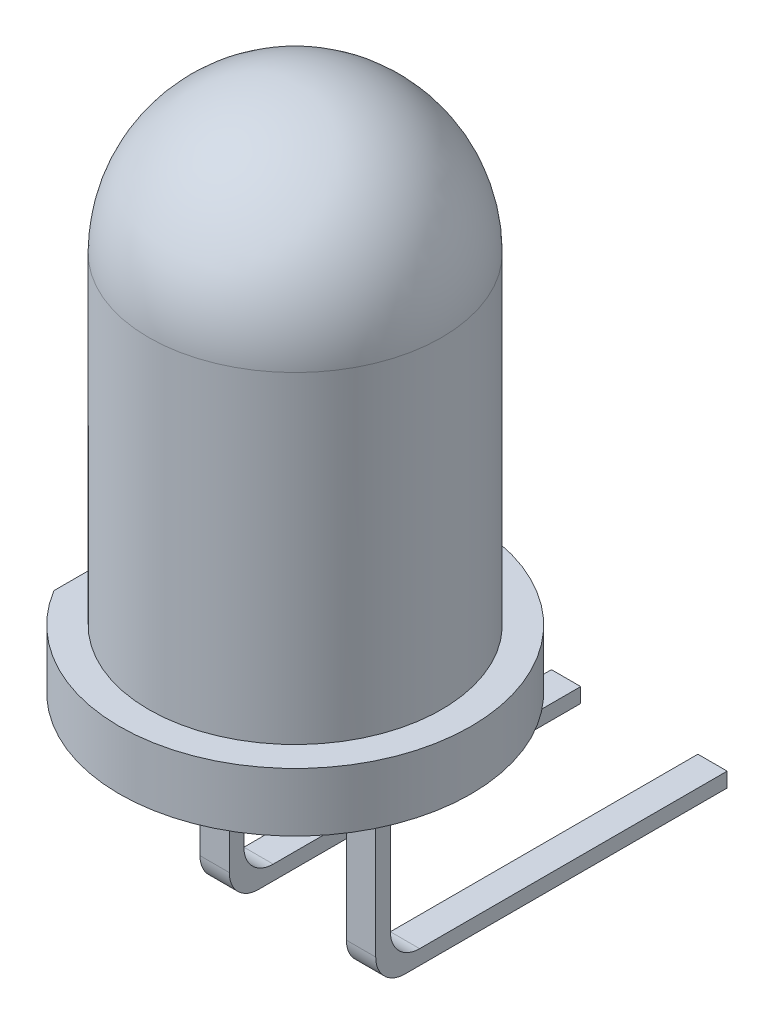
ISO-10303-21;
HEADER;
FILE_DESCRIPTION(('STEP AP214'),'2;1');
FILE_NAME('part.step','',(''),(''),'','','');
FILE_SCHEMA(('AUTOMOTIVE_DESIGN { 1 0 10303 214 1 1 1 1 }'));
ENDSEC;
DATA;
#1=APPLICATION_CONTEXT('core data for automotive mechanical design processes');
#2=APPLICATION_PROTOCOL_DEFINITION('international standard','automotive_design',2000,#1);
#3=PRODUCT_CONTEXT('',#1,'mechanical');
#4=PRODUCT('Part','Part','',(#3));
#5=PRODUCT_RELATED_PRODUCT_CATEGORY('part','',(#4));
#6=PRODUCT_DEFINITION_FORMATION('','',#4);
#7=PRODUCT_DEFINITION_CONTEXT('part definition',#1,'design');
#8=PRODUCT_DEFINITION('design','',#6,#7);
#9=PRODUCT_DEFINITION_SHAPE('','',#8);
#10=(LENGTH_UNIT() NAMED_UNIT(*) SI_UNIT(.MILLI.,.METRE.));
#11=(NAMED_UNIT(*) PLANE_ANGLE_UNIT() SI_UNIT($,.RADIAN.));
#12=(NAMED_UNIT(*) SI_UNIT($,.STERADIAN.) SOLID_ANGLE_UNIT());
#13=UNCERTAINTY_MEASURE_WITH_UNIT(LENGTH_MEASURE(1.E-05),#10,'distance_accuracy_value','');
#14=(GEOMETRIC_REPRESENTATION_CONTEXT(3) GLOBAL_UNCERTAINTY_ASSIGNED_CONTEXT((#13)) GLOBAL_UNIT_ASSIGNED_CONTEXT((#10,
#11,#12)) REPRESENTATION_CONTEXT('',''));
#15=CARTESIAN_POINT('',(0.,0.,0.));
#16=DIRECTION('',(0.,0.,1.));
#17=DIRECTION('',(1.,0.,0.));
#18=AXIS2_PLACEMENT_3D('',#15,#16,#17);
#19=CARTESIAN_POINT('',(7.50520607473216,-10.0975485762322,0.125));
#20=DIRECTION('',(0.,-1.,0.));
#21=DIRECTION('',(0.,0.,-1.));
#22=AXIS2_PLACEMENT_3D('',#19,#20,#21);
#23=PLANE('',#22);
#24=DIRECTION('',(0.,0.,1.));
#25=VECTOR('',#24,1.);
#26=CARTESIAN_POINT('',(-1.,-10.0975485762322,-9.875));
#27=LINE('',#26,#25);
#28=CARTESIAN_POINT('',(-1.,-10.0975485762322,-5.875));
#29=VERTEX_POINT('',#28);
#30=CARTESIAN_POINT('',(-1.,-10.0975485762322,-0.375));
#31=VERTEX_POINT('',#30);
#32=EDGE_CURVE('E168',#29,#31,#27,.T.);
#33=ORIENTED_EDGE('',*,*,#32,.T.);
#34=DIRECTION('',(-1.,0.,0.));
#35=VECTOR('',#34,1.);
#36=CARTESIAN_POINT('',(-1.5,-10.0975485762322,-0.375));
#37=LINE('',#36,#35);
#38=CARTESIAN_POINT('',(-1.5,-10.0975485762322,-0.375));
#39=VERTEX_POINT('',#38);
#40=EDGE_CURVE('E280',#31,#39,#37,.T.);
#41=ORIENTED_EDGE('',*,*,#40,.T.);
#42=DIRECTION('',(0.,0.,1.));
#43=VECTOR('',#42,1.);
#44=CARTESIAN_POINT('',(-1.5,-10.0975485762322,0.125));
#45=LINE('',#44,#43);
#46=CARTESIAN_POINT('',(-1.5,-10.0975485762322,-5.875));
#47=VERTEX_POINT('',#46);
#48=EDGE_CURVE('E189',#47,#39,#45,.T.);
#49=ORIENTED_EDGE('',*,*,#48,.F.);
#50=DIRECTION('',(-1.,0.,0.));
#51=VECTOR('',#50,1.);
#52=CARTESIAN_POINT('',(7.50520607473216,-10.0975485762322,-5.875));
#53=LINE('',#52,#51);
#54=EDGE_CURVE('E182',#29,#47,#53,.T.);
#55=ORIENTED_EDGE('',*,*,#54,.F.);
#56=EDGE_LOOP('',(#33,#41,#49,#55));
#57=FACE_BOUND('',#56,.T.);
#58=ADVANCED_FACE('F33',(#57),#23,.T.);
#59=CARTESIAN_POINT('',(7.50520607473216,-10.0975485762322,-5.875));
#60=DIRECTION('',(0.,0.,-1.));
#61=DIRECTION('',(-1.,0.,0.));
#62=AXIS2_PLACEMENT_3D('',#59,#60,#61);
#63=PLANE('',#62);
#64=DIRECTION('',(0.,1.,0.));
#65=VECTOR('',#64,1.);
#66=CARTESIAN_POINT('',(-0.999999999999999,-10.0975485762322,-5.875));
#67=LINE('',#66,#65);
#68=CARTESIAN_POINT('',(-0.999999999999999,-9.84754857623216,-5.875));
#69=VERTEX_POINT('',#68);
#70=EDGE_CURVE('E177',#29,#69,#67,.T.);
#71=ORIENTED_EDGE('',*,*,#70,.F.);
#72=ORIENTED_EDGE('',*,*,#54,.T.);
#73=DIRECTION('',(0.,-1.,0.));
#74=VECTOR('',#73,1.);
#75=CARTESIAN_POINT('',(-1.5,-10.0975485762322,-5.875));
#76=LINE('',#75,#74);
#77=CARTESIAN_POINT('',(-1.5,-9.84754857623216,-5.875));
#78=VERTEX_POINT('',#77);
#79=EDGE_CURVE('E304',#78,#47,#76,.T.);
#80=ORIENTED_EDGE('',*,*,#79,.F.);
#81=DIRECTION('',(-1.,0.,0.));
#82=VECTOR('',#81,1.);
#83=CARTESIAN_POINT('',(7.50520607473216,-9.84754857623216,-5.875));
#84=LINE('',#83,#82);
#85=EDGE_CURVE('E192',#69,#78,#84,.T.);
#86=ORIENTED_EDGE('',*,*,#85,.F.);
#87=EDGE_LOOP('',(#71,#72,#80,#86));
#88=FACE_BOUND('',#87,.T.);
#89=ADVANCED_FACE('F332',(#88),#63,.T.);
#90=CARTESIAN_POINT('',(7.50520607473216,-9.84754857623216,-5.875));
#91=DIRECTION('',(0.,1.,0.));
#92=DIRECTION('',(0.,0.,1.));
#93=AXIS2_PLACEMENT_3D('',#90,#91,#92);
#94=PLANE('',#93);
#95=DIRECTION('',(0.,0.,-1.));
#96=VECTOR('',#95,1.);
#97=CARTESIAN_POINT('',(-1.5,-9.84754857623216,-5.875));
#98=LINE('',#97,#96);
#99=CARTESIAN_POINT('',(-1.5,-9.84754857623216,-0.625));
#100=VERTEX_POINT('',#99);
#101=EDGE_CURVE('E294',#100,#78,#98,.T.);
#102=ORIENTED_EDGE('',*,*,#101,.F.);
#103=DIRECTION('',(-1.,0.,0.));
#104=VECTOR('',#103,1.);
#105=CARTESIAN_POINT('',(7.50520607473216,-9.84754857623216,-0.624999999999999));
#106=LINE('',#105,#104);
#107=CARTESIAN_POINT('',(-0.999999999999999,-9.84754857623216,-0.625));
#108=VERTEX_POINT('',#107);
#109=EDGE_CURVE('E271',#100,#108,#106,.F.);
#110=ORIENTED_EDGE('',*,*,#109,.T.);
#111=DIRECTION('',(0.,0.,1.));
#112=VECTOR('',#111,1.);
#113=CARTESIAN_POINT('',(-0.999999999999999,-9.84754857623216,-5.875));
#114=LINE('',#113,#112);
#115=EDGE_CURVE('E260',#69,#108,#114,.T.);
#116=ORIENTED_EDGE('',*,*,#115,.F.);
#117=ORIENTED_EDGE('',*,*,#85,.T.);
#118=EDGE_LOOP('',(#102,#110,#116,#117));
#119=FACE_BOUND('',#118,.T.);
#120=ADVANCED_FACE('F300',(#119),#94,.T.);
#121=CARTESIAN_POINT('',(-1.,-36.5,0.125));
#122=DIRECTION('',(-1.,0.,0.));
#123=DIRECTION('',(0.,0.,1.));
#124=AXIS2_PLACEMENT_3D('',#121,#122,#123);
#125=PLANE('',#124);
#126=DIRECTION('',(0.,1.,0.));
#127=VECTOR('',#126,1.);
#128=CARTESIAN_POINT('',(-1.,-36.5,0.125));
#129=LINE('',#128,#127);
#130=CARTESIAN_POINT('',(-1.,-9.59754857623216,0.125));
#131=VERTEX_POINT('',#130);
#132=CARTESIAN_POINT('',(-1.,-6.5,0.125));
#133=VERTEX_POINT('',#132);
#134=EDGE_CURVE('E216',#131,#133,#129,.T.);
#135=ORIENTED_EDGE('',*,*,#134,.F.);
#136=CARTESIAN_POINT('',(-1.,-9.59754857623216,-0.375));
#137=DIRECTION('',(-1.,0.,0.));
#138=DIRECTION('',(0.,0.,1.));
#139=AXIS2_PLACEMENT_3D('',#136,#137,#138);
#140=CIRCLE('',#139,0.5);
#141=EDGE_CURVE('E285',#131,#31,#140,.F.);
#142=ORIENTED_EDGE('',*,*,#141,.T.);
#143=ORIENTED_EDGE('',*,*,#32,.F.);
#144=ORIENTED_EDGE('',*,*,#70,.T.);
#145=ORIENTED_EDGE('',*,*,#115,.T.);
#146=CARTESIAN_POINT('',(-1.,-9.34754857623216,-0.625));
#147=DIRECTION('',(-1.,0.,0.));
#148=DIRECTION('',(0.,0.,1.));
#149=AXIS2_PLACEMENT_3D('',#146,#147,#148);
#150=CIRCLE('',#149,0.5);
#151=CARTESIAN_POINT('',(-1.,-9.34754857623216,-0.125));
#152=VERTEX_POINT('',#151);
#153=EDGE_CURVE('E11',#108,#152,#150,.T.);
#154=ORIENTED_EDGE('',*,*,#153,.T.);
#155=DIRECTION('',(0.,1.,0.));
#156=VECTOR('',#155,1.);
#157=CARTESIAN_POINT('',(-1.,-36.5,-0.125));
#158=LINE('',#157,#156);
#159=CARTESIAN_POINT('',(-1.,-6.5,-0.125));
#160=VERTEX_POINT('',#159);
#161=EDGE_CURVE('E218',#152,#160,#158,.T.);
#162=ORIENTED_EDGE('',*,*,#161,.T.);
#163=DIRECTION('',(0.,0.,1.));
#164=VECTOR('',#163,1.);
#165=CARTESIAN_POINT('',(-1.,-6.5,0.125));
#166=LINE('',#165,#164);
#167=EDGE_CURVE('E213',#160,#133,#166,.T.);
#168=ORIENTED_EDGE('',*,*,#167,.T.);
#169=EDGE_LOOP('',(#135,#142,#143,#144,#145,#154,#162,#168));
#170=FACE_BOUND('',#169,.T.);
#171=ADVANCED_FACE('F310',(#170),#125,.F.);
#172=CARTESIAN_POINT('',(1.,-36.5,0.125));
#173=DIRECTION('',(1.,0.,0.));
#174=DIRECTION('',(0.,0.,-1.));
#175=AXIS2_PLACEMENT_3D('',#172,#173,#174);
#176=PLANE('',#175);
#177=DIRECTION('',(0.,0.,1.));
#178=VECTOR('',#177,1.);
#179=CARTESIAN_POINT('',(1.,-10.0975485762322,-9.875));
#180=LINE('',#179,#178);
#181=CARTESIAN_POINT('',(1.,-10.0975485762322,-5.875));
#182=VERTEX_POINT('',#181);
#183=CARTESIAN_POINT('',(1.,-10.0975485762322,-0.375));
#184=VERTEX_POINT('',#183);
#185=EDGE_CURVE('E158',#182,#184,#180,.T.);
#186=ORIENTED_EDGE('',*,*,#185,.T.);
#187=CARTESIAN_POINT('',(1.,-9.59754857623216,-0.375));
#188=DIRECTION('',(1.,0.,0.));
#189=DIRECTION('',(0.,0.,-1.));
#190=AXIS2_PLACEMENT_3D('',#187,#188,#189);
#191=CIRCLE('',#190,0.5);
#192=CARTESIAN_POINT('',(1.,-9.59754857623216,0.125));
#193=VERTEX_POINT('',#192);
#194=EDGE_CURVE('E274',#184,#193,#191,.F.);
#195=ORIENTED_EDGE('',*,*,#194,.T.);
#196=DIRECTION('',(0.,1.,0.));
#197=VECTOR('',#196,1.);
#198=CARTESIAN_POINT('',(1.,-36.5,0.125));
#199=LINE('',#198,#197);
#200=CARTESIAN_POINT('',(1.,-6.5,0.125));
#201=VERTEX_POINT('',#200);
#202=EDGE_CURVE('E236',#193,#201,#199,.T.);
#203=ORIENTED_EDGE('',*,*,#202,.T.);
#204=DIRECTION('',(0.,0.,-1.));
#205=VECTOR('',#204,1.);
#206=CARTESIAN_POINT('',(1.,-6.5,0.125));
#207=LINE('',#206,#205);
#208=CARTESIAN_POINT('',(1.,-6.5,-0.125));
#209=VERTEX_POINT('',#208);
#210=EDGE_CURVE('E224',#201,#209,#207,.T.);
#211=ORIENTED_EDGE('',*,*,#210,.T.);
#212=DIRECTION('',(0.,1.,0.));
#213=VECTOR('',#212,1.);
#214=CARTESIAN_POINT('',(1.,-36.5,-0.125));
#215=LINE('',#214,#213);
#216=CARTESIAN_POINT('',(1.,-9.34754857623216,-0.125));
#217=VERTEX_POINT('',#216);
#218=EDGE_CURVE('E242',#217,#209,#215,.T.);
#219=ORIENTED_EDGE('',*,*,#218,.F.);
#220=CARTESIAN_POINT('',(1.,-9.34754857623216,-0.625));
#221=DIRECTION('',(1.,0.,0.));
#222=DIRECTION('',(0.,0.,-1.));
#223=AXIS2_PLACEMENT_3D('',#220,#221,#222);
#224=CIRCLE('',#223,0.5);
#225=CARTESIAN_POINT('',(1.,-9.84754857623216,-0.625));
#226=VERTEX_POINT('',#225);
#227=EDGE_CURVE('E287',#217,#226,#224,.T.);
#228=ORIENTED_EDGE('',*,*,#227,.T.);
#229=DIRECTION('',(0.,0.,-1.));
#230=VECTOR('',#229,1.);
#231=CARTESIAN_POINT('',(1.,-9.84754857623216,-5.875));
#232=LINE('',#231,#230);
#233=CARTESIAN_POINT('',(1.,-9.84754857623216,-5.875));
#234=VERTEX_POINT('',#233);
#235=EDGE_CURVE('E173',#226,#234,#232,.T.);
#236=ORIENTED_EDGE('',*,*,#235,.T.);
#237=DIRECTION('',(0.,-1.,0.));
#238=VECTOR('',#237,1.);
#239=CARTESIAN_POINT('',(1.,-10.0975485762322,-5.875));
#240=LINE('',#239,#238);
#241=EDGE_CURVE('E167',#234,#182,#240,.T.);
#242=ORIENTED_EDGE('',*,*,#241,.T.);
#243=EDGE_LOOP('',(#186,#195,#203,#211,#219,#228,#236,#242));
#244=FACE_BOUND('',#243,.T.);
#245=ADVANCED_FACE('F171',(#244),#176,.F.);
#246=CARTESIAN_POINT('',(-1.,-36.5,0.125));
#247=DIRECTION('',(0.,0.,-1.));
#248=DIRECTION('',(-1.,0.,0.));
#249=AXIS2_PLACEMENT_3D('',#246,#247,#248);
#250=PLANE('',#249);
#251=DIRECTION('',(0.,1.,0.));
#252=VECTOR('',#251,1.);
#253=CARTESIAN_POINT('',(-1.5,-36.5,0.125));
#254=LINE('',#253,#252);
#255=CARTESIAN_POINT('',(-1.5,-9.59754857623216,0.125));
#256=VERTEX_POINT('',#255);
#257=CARTESIAN_POINT('',(-1.5,-6.5,0.125));
#258=VERTEX_POINT('',#257);
#259=EDGE_CURVE('E222',#256,#258,#254,.T.);
#260=ORIENTED_EDGE('',*,*,#259,.F.);
#261=DIRECTION('',(-1.,0.,0.));
#262=VECTOR('',#261,1.);
#263=CARTESIAN_POINT('',(-1.,-9.59754857623216,0.125));
#264=LINE('',#263,#262);
#265=EDGE_CURVE('E48',#256,#131,#264,.F.);
#266=ORIENTED_EDGE('',*,*,#265,.T.);
#267=ORIENTED_EDGE('',*,*,#134,.T.);
#268=DIRECTION('',(-1.,0.,0.));
#269=VECTOR('',#268,1.);
#270=CARTESIAN_POINT('',(-1.,-6.5,0.125));
#271=LINE('',#270,#269);
#272=EDGE_CURVE('E204',#133,#258,#271,.T.);
#273=ORIENTED_EDGE('',*,*,#272,.T.);
#274=EDGE_LOOP('',(#260,#266,#267,#273));
#275=FACE_BOUND('',#274,.T.);
#276=ADVANCED_FACE('F319',(#275),#250,.F.);
#277=CARTESIAN_POINT('',(-1.5,-36.5,0.125));
#278=DIRECTION('',(1.,0.,0.));
#279=DIRECTION('',(0.,0.,-1.));
#280=AXIS2_PLACEMENT_3D('',#277,#278,#279);
#281=PLANE('',#280);
#282=ORIENTED_EDGE('',*,*,#48,.T.);
#283=CARTESIAN_POINT('',(-1.5,-9.59754857623216,-0.375));
#284=DIRECTION('',(1.,0.,0.));
#285=DIRECTION('',(0.,0.,-1.));
#286=AXIS2_PLACEMENT_3D('',#283,#284,#285);
#287=CIRCLE('',#286,0.5);
#288=EDGE_CURVE('E56',#39,#256,#287,.F.);
#289=ORIENTED_EDGE('',*,*,#288,.T.);
#290=ORIENTED_EDGE('',*,*,#259,.T.);
#291=DIRECTION('',(0.,0.,-1.));
#292=VECTOR('',#291,1.);
#293=CARTESIAN_POINT('',(-1.5,-6.5,0.125));
#294=LINE('',#293,#292);
#295=CARTESIAN_POINT('',(-1.5,-6.5,-0.125));
#296=VERTEX_POINT('',#295);
#297=EDGE_CURVE('E207',#258,#296,#294,.T.);
#298=ORIENTED_EDGE('',*,*,#297,.T.);
#299=DIRECTION('',(0.,1.,0.));
#300=VECTOR('',#299,1.);
#301=CARTESIAN_POINT('',(-1.5,-36.5,-0.125));
#302=LINE('',#301,#300);
#303=CARTESIAN_POINT('',(-1.5,-9.34754857623216,-0.125));
#304=VERTEX_POINT('',#303);
#305=EDGE_CURVE('E220',#304,#296,#302,.T.);
#306=ORIENTED_EDGE('',*,*,#305,.F.);
#307=CARTESIAN_POINT('',(-1.5,-9.34754857623216,-0.625));
#308=DIRECTION('',(1.,0.,0.));
#309=DIRECTION('',(0.,0.,-1.));
#310=AXIS2_PLACEMENT_3D('',#307,#308,#309);
#311=CIRCLE('',#310,0.5);
#312=EDGE_CURVE('E41',#304,#100,#311,.T.);
#313=ORIENTED_EDGE('',*,*,#312,.T.);
#314=ORIENTED_EDGE('',*,*,#101,.T.);
#315=ORIENTED_EDGE('',*,*,#79,.T.);
#316=EDGE_LOOP('',(#282,#289,#290,#298,#306,#313,#314,#315));
#317=FACE_BOUND('',#316,.T.);
#318=ADVANCED_FACE('F292',(#317),#281,.F.);
#319=CARTESIAN_POINT('',(-1.,-36.5,-0.125));
#320=DIRECTION('',(0.,0.,1.));
#321=DIRECTION('',(1.,0.,0.));
#322=AXIS2_PLACEMENT_3D('',#319,#320,#321);
#323=PLANE('',#322);
#324=ORIENTED_EDGE('',*,*,#161,.F.);
#325=DIRECTION('',(-1.,0.,0.));
#326=VECTOR('',#325,1.);
#327=CARTESIAN_POINT('',(-1.,-9.34754857623216,-0.125));
#328=LINE('',#327,#326);
#329=EDGE_CURVE('E268',#152,#304,#328,.T.);
#330=ORIENTED_EDGE('',*,*,#329,.T.);
#331=ORIENTED_EDGE('',*,*,#305,.T.);
#332=DIRECTION('',(1.,0.,0.));
#333=VECTOR('',#332,1.);
#334=CARTESIAN_POINT('',(-1.,-6.5,-0.125));
#335=LINE('',#334,#333);
#336=EDGE_CURVE('E210',#296,#160,#335,.T.);
#337=ORIENTED_EDGE('',*,*,#336,.T.);
#338=EDGE_LOOP('',(#324,#330,#331,#337));
#339=FACE_BOUND('',#338,.T.);
#340=ADVANCED_FACE('F313',(#339),#323,.F.);
#341=CARTESIAN_POINT('',(0.,-6.5,0.));
#342=DIRECTION('',(0.,1.,0.));
#343=DIRECTION('',(0.,0.,1.));
#344=AXIS2_PLACEMENT_3D('',#341,#342,#343);
#345=PLANE('',#344);
#346=ORIENTED_EDGE('',*,*,#210,.F.);
#347=DIRECTION('',(-1.,0.,0.));
#348=VECTOR('',#347,1.);
#349=CARTESIAN_POINT('',(1.,-6.5,0.125));
#350=LINE('',#349,#348);
#351=CARTESIAN_POINT('',(1.5,-6.5,0.125));
#352=VERTEX_POINT('',#351);
#353=EDGE_CURVE('E233',#352,#201,#350,.T.);
#354=ORIENTED_EDGE('',*,*,#353,.F.);
#355=DIRECTION('',(0.,0.,1.));
#356=VECTOR('',#355,1.);
#357=CARTESIAN_POINT('',(1.5,-6.5,0.125));
#358=LINE('',#357,#356);
#359=CARTESIAN_POINT('',(1.5,-6.5,-0.125));
#360=VERTEX_POINT('',#359);
#361=EDGE_CURVE('E230',#360,#352,#358,.T.);
#362=ORIENTED_EDGE('',*,*,#361,.F.);
#363=DIRECTION('',(1.,0.,0.));
#364=VECTOR('',#363,1.);
#365=CARTESIAN_POINT('',(1.,-6.5,-0.125));
#366=LINE('',#365,#364);
#367=EDGE_CURVE('E227',#209,#360,#366,.T.);
#368=ORIENTED_EDGE('',*,*,#367,.F.);
#369=EDGE_LOOP('',(#346,#354,#362,#368));
#370=FACE_BOUND('',#369,.T.);
#371=CARTESIAN_POINT('',(0.,-6.5,0.));
#372=DIRECTION('',(0.,1.,0.));
#373=DIRECTION('',(0.,0.,1.));
#374=AXIS2_PLACEMENT_3D('',#371,#372,#373);
#375=CIRCLE('',#374,3.);
#376=CARTESIAN_POINT('',(-2.56751766388456,-6.5,1.55172582811551));
#377=VERTEX_POINT('',#376);
#378=CARTESIAN_POINT('',(-2.56751766388456,-6.5,-1.55172582811551));
#379=VERTEX_POINT('',#378);
#380=EDGE_CURVE('E253',#377,#379,#375,.T.);
#381=ORIENTED_EDGE('',*,*,#380,.F.);
#382=DIRECTION('',(0.,0.,1.));
#383=VECTOR('',#382,1.);
#384=CARTESIAN_POINT('',(-2.56751766388456,-6.5,1.75));
#385=LINE('',#384,#383);
#386=EDGE_CURVE('E196',#379,#377,#385,.T.);
#387=ORIENTED_EDGE('',*,*,#386,.F.);
#388=EDGE_LOOP('',(#381,#387));
#389=FACE_BOUND('',#388,.T.);
#390=ORIENTED_EDGE('',*,*,#272,.F.);
#391=ORIENTED_EDGE('',*,*,#167,.F.);
#392=ORIENTED_EDGE('',*,*,#336,.F.);
#393=ORIENTED_EDGE('',*,*,#297,.F.);
#394=EDGE_LOOP('',(#390,#391,#392,#393));
#395=FACE_BOUND('',#394,.T.);
#396=ADVANCED_FACE('F318',(#370,#389,#395),#345,.F.);
#397=CARTESIAN_POINT('',(0.,0.,0.));
#398=DIRECTION('',(0.,1.,0.));
#399=DIRECTION('',(1.,0.,0.));
#400=AXIS2_PLACEMENT_3D('',#397,#398,#399);
#401=SPHERICAL_SURFACE('',#400,2.5);
#402=CARTESIAN_POINT('',(0.,0.,0.));
#403=DIRECTION('',(0.,1.,0.));
#404=DIRECTION('',(0.,0.,1.));
#405=AXIS2_PLACEMENT_3D('',#402,#403,#404);
#406=CIRCLE('',#405,2.5);
#407=CARTESIAN_POINT('',(0.,0.,2.5));
#408=VERTEX_POINT('',#407);
#409=EDGE_CURVE('E244',#408,#408,#406,.T.);
#410=ORIENTED_EDGE('',*,*,#409,.T.);
#411=EDGE_LOOP('',(#410));
#412=FACE_BOUND('',#411,.T.);
#413=ADVANCED_FACE('F391',(#412),#401,.T.);
#414=CARTESIAN_POINT('',(0.,40.48125,0.));
#415=DIRECTION('',(0.,1.,0.));
#416=DIRECTION('',(0.,0.,1.));
#417=AXIS2_PLACEMENT_3D('',#414,#415,#416);
#418=CYLINDRICAL_SURFACE('',#417,3.);
#419=ORIENTED_EDGE('',*,*,#380,.T.);
#420=DIRECTION('',(0.,1.,0.));
#421=VECTOR('',#420,1.);
#422=CARTESIAN_POINT('',(-2.56751766388456,40.48125,-1.55172582811551));
#423=LINE('',#422,#421);
#424=CARTESIAN_POINT('',(-2.56751766388456,-5.5,-1.55172582811551));
#425=VERTEX_POINT('',#424);
#426=EDGE_CURVE('E201',#379,#425,#423,.T.);
#427=ORIENTED_EDGE('',*,*,#426,.T.);
#428=CARTESIAN_POINT('',(0.,-5.5,0.));
#429=DIRECTION('',(0.,1.,0.));
#430=DIRECTION('',(0.,0.,1.));
#431=AXIS2_PLACEMENT_3D('',#428,#429,#430);
#432=CIRCLE('',#431,3.);
#433=CARTESIAN_POINT('',(-2.56751766388456,-5.5,1.55172582811551));
#434=VERTEX_POINT('',#433);
#435=EDGE_CURVE('E250',#434,#425,#432,.T.);
#436=ORIENTED_EDGE('',*,*,#435,.F.);
#437=DIRECTION('',(0.,1.,0.));
#438=VECTOR('',#437,1.);
#439=CARTESIAN_POINT('',(-2.56751766388456,40.48125,1.55172582811551));
#440=LINE('',#439,#438);
#441=EDGE_CURVE('E198',#434,#377,#440,.F.);
#442=ORIENTED_EDGE('',*,*,#441,.T.);
#443=EDGE_LOOP('',(#419,#427,#436,#442));
#444=FACE_BOUND('',#443,.T.);
#445=ADVANCED_FACE('F387',(#444),#418,.T.);
#446=CARTESIAN_POINT('',(2.5,-5.5,0.));
#447=DIRECTION('',(0.,-1.,0.));
#448=DIRECTION('',(0.,0.,-1.));
#449=AXIS2_PLACEMENT_3D('',#446,#447,#448);
#450=PLANE('',#449);
#451=CARTESIAN_POINT('',(0.,-5.5,0.));
#452=DIRECTION('',(0.,1.,0.));
#453=DIRECTION('',(0.,0.,1.));
#454=AXIS2_PLACEMENT_3D('',#451,#452,#453);
#455=CIRCLE('',#454,2.5);
#456=CARTESIAN_POINT('',(0.,-5.5,2.5));
#457=VERTEX_POINT('',#456);
#458=EDGE_CURVE('E247',#457,#457,#455,.T.);
#459=ORIENTED_EDGE('',*,*,#458,.F.);
#460=EDGE_LOOP('',(#459));
#461=FACE_BOUND('',#460,.T.);
#462=ORIENTED_EDGE('',*,*,#435,.T.);
#463=DIRECTION('',(0.,0.,1.));
#464=VECTOR('',#463,1.);
#465=CARTESIAN_POINT('',(-2.56751766388456,-5.5,0.));
#466=LINE('',#465,#464);
#467=EDGE_CURVE('E256',#425,#434,#466,.T.);
#468=ORIENTED_EDGE('',*,*,#467,.T.);
#469=EDGE_LOOP('',(#462,#468));
#470=FACE_BOUND('',#469,.T.);
#471=ADVANCED_FACE('F383',(#461,#470),#450,.F.);
#472=CARTESIAN_POINT('',(0.,40.48125,0.));
#473=DIRECTION('',(0.,1.,0.));
#474=DIRECTION('',(0.,0.,1.));
#475=AXIS2_PLACEMENT_3D('',#472,#473,#474);
#476=CYLINDRICAL_SURFACE('',#475,2.5);
#477=ORIENTED_EDGE('',*,*,#409,.F.);
#478=EDGE_LOOP('',(#477));
#479=FACE_BOUND('',#478,.T.);
#480=ORIENTED_EDGE('',*,*,#458,.T.);
#481=EDGE_LOOP('',(#480));
#482=FACE_BOUND('',#481,.T.);
#483=ADVANCED_FACE('F377',(#479,#482),#476,.T.);
#484=CARTESIAN_POINT('',(1.,-36.5,-0.125));
#485=DIRECTION('',(0.,0.,1.));
#486=DIRECTION('',(1.,0.,0.));
#487=AXIS2_PLACEMENT_3D('',#484,#485,#486);
#488=PLANE('',#487);
#489=DIRECTION('',(0.,1.,0.));
#490=VECTOR('',#489,1.);
#491=CARTESIAN_POINT('',(1.5,-36.5,-0.125));
#492=LINE('',#491,#490);
#493=CARTESIAN_POINT('',(1.5,-9.34754857623216,-0.125));
#494=VERTEX_POINT('',#493);
#495=EDGE_CURVE('E240',#494,#360,#492,.T.);
#496=ORIENTED_EDGE('',*,*,#495,.F.);
#497=DIRECTION('',(-1.,0.,0.));
#498=VECTOR('',#497,1.);
#499=CARTESIAN_POINT('',(1.,-9.34754857623216,-0.125));
#500=LINE('',#499,#498);
#501=EDGE_CURVE('E263',#494,#217,#500,.T.);
#502=ORIENTED_EDGE('',*,*,#501,.T.);
#503=ORIENTED_EDGE('',*,*,#218,.T.);
#504=ORIENTED_EDGE('',*,*,#367,.T.);
#505=EDGE_LOOP('',(#496,#502,#503,#504));
#506=FACE_BOUND('',#505,.T.);
#507=ADVANCED_FACE('F373',(#506),#488,.F.);
#508=CARTESIAN_POINT('',(1.5,-36.5,0.125));
#509=DIRECTION('',(-1.,0.,0.));
#510=DIRECTION('',(0.,0.,1.));
#511=AXIS2_PLACEMENT_3D('',#508,#509,#510);
#512=PLANE('',#511);
#513=DIRECTION('',(0.,1.,0.));
#514=VECTOR('',#513,1.);
#515=CARTESIAN_POINT('',(1.5,-36.5,0.125));
#516=LINE('',#515,#514);
#517=CARTESIAN_POINT('',(1.5,-9.59754857623216,0.125));
#518=VERTEX_POINT('',#517);
#519=EDGE_CURVE('E238',#518,#352,#516,.T.);
#520=ORIENTED_EDGE('',*,*,#519,.F.);
#521=CARTESIAN_POINT('',(1.5,-9.59754857623216,-0.375));
#522=DIRECTION('',(-1.,0.,0.));
#523=DIRECTION('',(0.,0.,1.));
#524=AXIS2_PLACEMENT_3D('',#521,#522,#523);
#525=CIRCLE('',#524,0.5);
#526=CARTESIAN_POINT('',(1.5,-10.0975485762322,-0.375));
#527=VERTEX_POINT('',#526);
#528=EDGE_CURVE('E278',#518,#527,#525,.F.);
#529=ORIENTED_EDGE('',*,*,#528,.T.);
#530=DIRECTION('',(0.,0.,-1.));
#531=VECTOR('',#530,1.);
#532=CARTESIAN_POINT('',(1.5,-10.0975485762322,0.125));
#533=LINE('',#532,#531);
#534=CARTESIAN_POINT('',(1.5,-10.0975485762322,-5.875));
#535=VERTEX_POINT('',#534);
#536=EDGE_CURVE('E184',#527,#535,#533,.T.);
#537=ORIENTED_EDGE('',*,*,#536,.T.);
#538=DIRECTION('',(0.,1.,0.));
#539=VECTOR('',#538,1.);
#540=CARTESIAN_POINT('',(1.5,-10.0975485762322,-5.875));
#541=LINE('',#540,#539);
#542=CARTESIAN_POINT('',(1.5,-9.84754857623216,-5.875));
#543=VERTEX_POINT('',#542);
#544=EDGE_CURVE('E181',#535,#543,#541,.T.);
#545=ORIENTED_EDGE('',*,*,#544,.T.);
#546=DIRECTION('',(0.,0.,1.));
#547=VECTOR('',#546,1.);
#548=CARTESIAN_POINT('',(1.5,-9.84754857623216,-5.875));
#549=LINE('',#548,#547);
#550=CARTESIAN_POINT('',(1.5,-9.84754857623216,-0.625));
#551=VERTEX_POINT('',#550);
#552=EDGE_CURVE('E193',#543,#551,#549,.T.);
#553=ORIENTED_EDGE('',*,*,#552,.T.);
#554=CARTESIAN_POINT('',(1.5,-9.34754857623216,-0.625));
#555=DIRECTION('',(-1.,0.,0.));
#556=DIRECTION('',(0.,0.,1.));
#557=AXIS2_PLACEMENT_3D('',#554,#555,#556);
#558=CIRCLE('',#557,0.5);
#559=EDGE_CURVE('E289',#551,#494,#558,.T.);
#560=ORIENTED_EDGE('',*,*,#559,.T.);
#561=ORIENTED_EDGE('',*,*,#495,.T.);
#562=ORIENTED_EDGE('',*,*,#361,.T.);
#563=EDGE_LOOP('',(#520,#529,#537,#545,#553,#560,#561,#562));
#564=FACE_BOUND('',#563,.T.);
#565=ADVANCED_FACE('F359',(#564),#512,.F.);
#566=CARTESIAN_POINT('',(1.,-36.5,0.125));
#567=DIRECTION('',(0.,0.,-1.));
#568=DIRECTION('',(-1.,0.,0.));
#569=AXIS2_PLACEMENT_3D('',#566,#567,#568);
#570=PLANE('',#569);
#571=ORIENTED_EDGE('',*,*,#202,.F.);
#572=DIRECTION('',(-1.,0.,0.));
#573=VECTOR('',#572,1.);
#574=CARTESIAN_POINT('',(1.5,-9.59754857623216,0.125));
#575=LINE('',#574,#573);
#576=EDGE_CURVE('E276',#193,#518,#575,.F.);
#577=ORIENTED_EDGE('',*,*,#576,.T.);
#578=ORIENTED_EDGE('',*,*,#519,.T.);
#579=ORIENTED_EDGE('',*,*,#353,.T.);
#580=EDGE_LOOP('',(#571,#577,#578,#579));
#581=FACE_BOUND('',#580,.T.);
#582=ADVANCED_FACE('F353',(#581),#570,.F.);
#583=CARTESIAN_POINT('',(-2.56751766388456,-4.5,1.75));
#584=DIRECTION('',(1.,0.,0.));
#585=DIRECTION('',(0.,0.,-1.));
#586=AXIS2_PLACEMENT_3D('',#583,#584,#585);
#587=PLANE('',#586);
#588=ORIENTED_EDGE('',*,*,#386,.T.);
#589=ORIENTED_EDGE('',*,*,#441,.F.);
#590=ORIENTED_EDGE('',*,*,#467,.F.);
#591=ORIENTED_EDGE('',*,*,#426,.F.);
#592=EDGE_LOOP('',(#588,#589,#590,#591));
#593=FACE_BOUND('',#592,.T.);
#594=ADVANCED_FACE('F349',(#593),#587,.F.);
#595=ORIENTED_EDGE('',*,*,#536,.F.);
#596=DIRECTION('',(-1.,0.,0.));
#597=VECTOR('',#596,1.);
#598=CARTESIAN_POINT('',(1.,-10.0975485762322,-0.375));
#599=LINE('',#598,#597);
#600=EDGE_CURVE('E165',#527,#184,#599,.T.);
#601=ORIENTED_EDGE('',*,*,#600,.T.);
#602=ORIENTED_EDGE('',*,*,#185,.F.);
#603=EDGE_CURVE('E163',#535,#182,#53,.T.);
#604=ORIENTED_EDGE('',*,*,#603,.F.);
#605=EDGE_LOOP('',(#595,#601,#602,#604));
#606=FACE_BOUND('',#605,.T.);
#607=ADVANCED_FACE('F161',(#606),#23,.T.);
#608=ORIENTED_EDGE('',*,*,#241,.F.);
#609=EDGE_CURVE('E186',#543,#234,#84,.T.);
#610=ORIENTED_EDGE('',*,*,#609,.F.);
#611=ORIENTED_EDGE('',*,*,#544,.F.);
#612=ORIENTED_EDGE('',*,*,#603,.T.);
#613=EDGE_LOOP('',(#608,#610,#611,#612));
#614=FACE_BOUND('',#613,.T.);
#615=ADVANCED_FACE('F180',(#614),#63,.T.);
#616=ORIENTED_EDGE('',*,*,#235,.F.);
#617=DIRECTION('',(-1.,0.,0.));
#618=VECTOR('',#617,1.);
#619=CARTESIAN_POINT('',(7.50520607473216,-9.84754857623216,-0.625));
#620=LINE('',#619,#618);
#621=EDGE_CURVE('E266',#226,#551,#620,.F.);
#622=ORIENTED_EDGE('',*,*,#621,.T.);
#623=ORIENTED_EDGE('',*,*,#552,.F.);
#624=ORIENTED_EDGE('',*,*,#609,.T.);
#625=EDGE_LOOP('',(#616,#622,#623,#624));
#626=FACE_BOUND('',#625,.T.);
#627=ADVANCED_FACE('F340',(#626),#94,.T.);
#628=CARTESIAN_POINT('',(1.,-9.34754857623216,-0.625));
#629=DIRECTION('',(-1.,0.,0.));
#630=DIRECTION('',(0.,0.,1.));
#631=AXIS2_PLACEMENT_3D('',#628,#629,#630);
#632=CYLINDRICAL_SURFACE('',#631,0.5);
#633=ORIENTED_EDGE('',*,*,#559,.F.);
#634=ORIENTED_EDGE('',*,*,#621,.F.);
#635=ORIENTED_EDGE('',*,*,#227,.F.);
#636=ORIENTED_EDGE('',*,*,#501,.F.);
#637=EDGE_LOOP('',(#633,#634,#635,#636));
#638=FACE_BOUND('',#637,.T.);
#639=ADVANCED_FACE('F347',(#638),#632,.F.);
#640=CARTESIAN_POINT('',(-1.,-9.34754857623216,-0.625));
#641=DIRECTION('',(-1.,0.,0.));
#642=DIRECTION('',(0.,0.,1.));
#643=AXIS2_PLACEMENT_3D('',#640,#641,#642);
#644=CYLINDRICAL_SURFACE('',#643,0.5);
#645=ORIENTED_EDGE('',*,*,#153,.F.);
#646=ORIENTED_EDGE('',*,*,#109,.F.);
#647=ORIENTED_EDGE('',*,*,#312,.F.);
#648=ORIENTED_EDGE('',*,*,#329,.F.);
#649=EDGE_LOOP('',(#645,#646,#647,#648));
#650=FACE_BOUND('',#649,.T.);
#651=ADVANCED_FACE('F307',(#650),#644,.F.);
#652=CARTESIAN_POINT('',(7.50520607473216,-9.59754857623216,-0.375));
#653=DIRECTION('',(1.,0.,0.));
#654=DIRECTION('',(0.,0.,-1.));
#655=AXIS2_PLACEMENT_3D('',#652,#653,#654);
#656=CYLINDRICAL_SURFACE('',#655,0.5);
#657=ORIENTED_EDGE('',*,*,#528,.F.);
#658=ORIENTED_EDGE('',*,*,#576,.F.);
#659=ORIENTED_EDGE('',*,*,#194,.F.);
#660=ORIENTED_EDGE('',*,*,#600,.F.);
#661=EDGE_LOOP('',(#657,#658,#659,#660));
#662=FACE_BOUND('',#661,.T.);
#663=ADVANCED_FACE('F403',(#662),#656,.T.);
#664=CARTESIAN_POINT('',(7.50520607473216,-9.59754857623216,-0.374999999999986));
#665=DIRECTION('',(1.,0.,0.));
#666=DIRECTION('',(0.,0.,-1.));
#667=AXIS2_PLACEMENT_3D('',#664,#665,#666);
#668=CYLINDRICAL_SURFACE('',#667,0.5);
#669=ORIENTED_EDGE('',*,*,#141,.F.);
#670=ORIENTED_EDGE('',*,*,#265,.F.);
#671=ORIENTED_EDGE('',*,*,#288,.F.);
#672=ORIENTED_EDGE('',*,*,#40,.F.);
#673=EDGE_LOOP('',(#669,#670,#671,#672));
#674=FACE_BOUND('',#673,.T.);
#675=ADVANCED_FACE('F35',(#674),#668,.T.);
#676=CLOSED_SHELL('',(#58,#89,#120,#171,#245,#276,#318,#340,#396,#413,#445,#471,#483,#507,#565,
#582,#594,#607,#615,#627,#639,#651,#663,#675));
#677=MANIFOLD_SOLID_BREP('B2',#676);
#678=ADVANCED_BREP_SHAPE_REPRESENTATION('',(#18,#677),#14);
#679=SHAPE_DEFINITION_REPRESENTATION(#9,#678);
ENDSEC;
END-ISO-10303-21;
